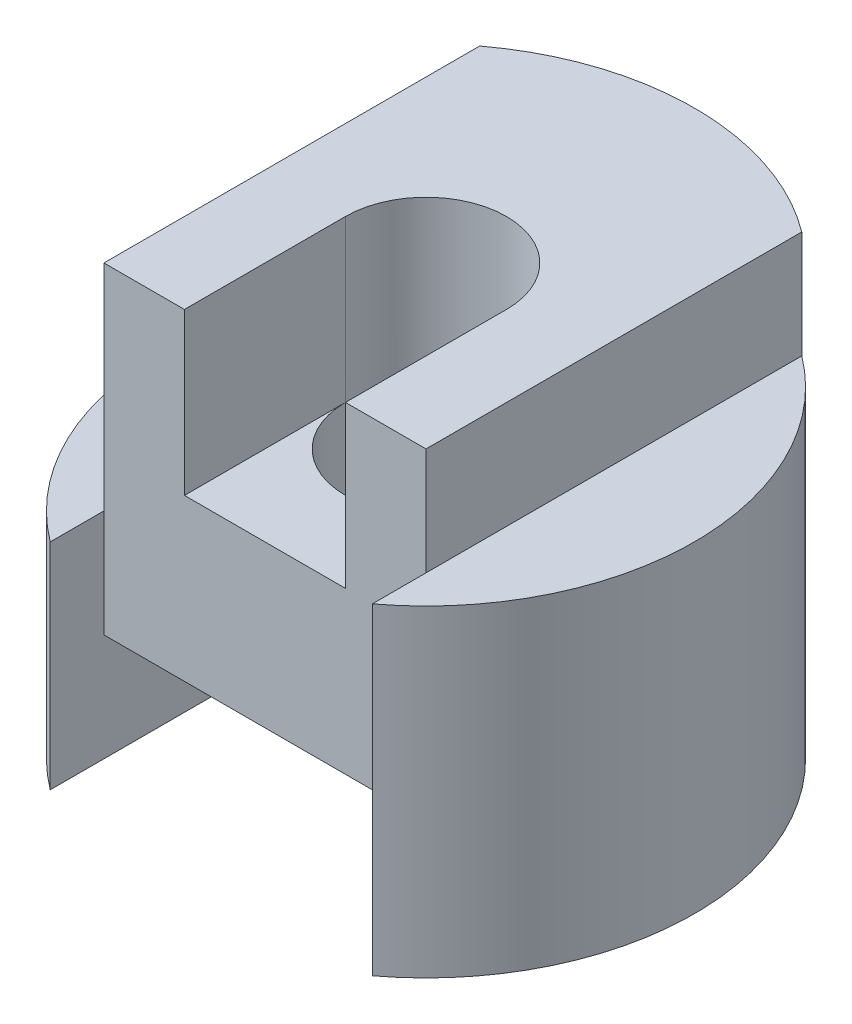
ISO-10303-21;
HEADER;
FILE_DESCRIPTION(('STEP AP214'),'2;1');
FILE_NAME('part.step','',(''),(''),'','','');
FILE_SCHEMA(('AUTOMOTIVE_DESIGN { 1 0 10303 214 1 1 1 1 }'));
ENDSEC;
DATA;
#1=APPLICATION_CONTEXT('core data for automotive mechanical design processes');
#2=APPLICATION_PROTOCOL_DEFINITION('international standard','automotive_design',2000,#1);
#3=PRODUCT_CONTEXT('',#1,'mechanical');
#4=PRODUCT('Part','Part','',(#3));
#5=PRODUCT_RELATED_PRODUCT_CATEGORY('part','',(#4));
#6=PRODUCT_DEFINITION_FORMATION('','',#4);
#7=PRODUCT_DEFINITION_CONTEXT('part definition',#1,'design');
#8=PRODUCT_DEFINITION('design','',#6,#7);
#9=PRODUCT_DEFINITION_SHAPE('','',#8);
#10=(LENGTH_UNIT() NAMED_UNIT(*) SI_UNIT(.MILLI.,.METRE.));
#11=(NAMED_UNIT(*) PLANE_ANGLE_UNIT() SI_UNIT($,.RADIAN.));
#12=(NAMED_UNIT(*) SI_UNIT($,.STERADIAN.) SOLID_ANGLE_UNIT());
#13=UNCERTAINTY_MEASURE_WITH_UNIT(LENGTH_MEASURE(1.E-05),#10,'distance_accuracy_value','');
#14=(GEOMETRIC_REPRESENTATION_CONTEXT(3) GLOBAL_UNCERTAINTY_ASSIGNED_CONTEXT((#13)) GLOBAL_UNIT_ASSIGNED_CONTEXT((#10,
#11,#12)) REPRESENTATION_CONTEXT('',''));
#15=CARTESIAN_POINT('',(0.,0.,0.));
#16=DIRECTION('',(0.,0.,1.));
#17=DIRECTION('',(1.,0.,0.));
#18=AXIS2_PLACEMENT_3D('',#15,#16,#17);
#19=CARTESIAN_POINT('',(0.,8.,0.));
#20=DIRECTION('',(0.,1.,0.));
#21=DIRECTION('',(0.,0.,1.));
#22=AXIS2_PLACEMENT_3D('',#19,#20,#21);
#23=PLANE('',#22);
#24=DIRECTION('',(1.,0.,0.));
#25=VECTOR('',#24,1.);
#26=CARTESIAN_POINT('',(-3.,8.,3.));
#27=LINE('',#26,#25);
#28=CARTESIAN_POINT('',(-3.,8.,3.));
#29=VERTEX_POINT('',#28);
#30=CARTESIAN_POINT('',(-1.5,8.,3.));
#31=VERTEX_POINT('',#30);
#32=EDGE_CURVE('E207',#29,#31,#27,.T.);
#33=ORIENTED_EDGE('',*,*,#32,.T.);
#34=DIRECTION('',(0.,0.,-1.));
#35=VECTOR('',#34,1.);
#36=CARTESIAN_POINT('',(-1.5,8.,18.));
#37=LINE('',#36,#35);
#38=CARTESIAN_POINT('',(-1.5,8.,0.));
#39=VERTEX_POINT('',#38);
#40=EDGE_CURVE('E151',#31,#39,#37,.T.);
#41=ORIENTED_EDGE('',*,*,#40,.T.);
#42=CARTESIAN_POINT('',(0.,8.,0.));
#43=DIRECTION('',(0.,1.,0.));
#44=DIRECTION('',(0.,0.,1.));
#45=AXIS2_PLACEMENT_3D('',#42,#43,#44);
#46=CIRCLE('',#45,1.5);
#47=CARTESIAN_POINT('',(1.5,8.,0.));
#48=VERTEX_POINT('',#47);
#49=EDGE_CURVE('E148',#48,#39,#46,.T.);
#50=ORIENTED_EDGE('',*,*,#49,.F.);
#51=DIRECTION('',(0.,0.,-1.));
#52=VECTOR('',#51,1.);
#53=CARTESIAN_POINT('',(1.5,8.,18.));
#54=LINE('',#53,#52);
#55=CARTESIAN_POINT('',(1.5,8.,3.));
#56=VERTEX_POINT('',#55);
#57=EDGE_CURVE('E48',#56,#48,#54,.T.);
#58=ORIENTED_EDGE('',*,*,#57,.F.);
#59=CARTESIAN_POINT('',(3.,8.,3.));
#60=VERTEX_POINT('',#59);
#61=EDGE_CURVE('E205',#56,#60,#27,.T.);
#62=ORIENTED_EDGE('',*,*,#61,.T.);
#63=DIRECTION('',(0.,0.,1.));
#64=VECTOR('',#63,1.);
#65=CARTESIAN_POINT('',(3.,8.,-9.));
#66=LINE('',#65,#64);
#67=CARTESIAN_POINT('',(3.,8.,-4.));
#68=VERTEX_POINT('',#67);
#69=EDGE_CURVE('E165',#68,#60,#66,.T.);
#70=ORIENTED_EDGE('',*,*,#69,.F.);
#71=CARTESIAN_POINT('',(0.,8.,0.));
#72=DIRECTION('',(0.,1.,0.));
#73=DIRECTION('',(0.,0.,1.));
#74=AXIS2_PLACEMENT_3D('',#71,#72,#73);
#75=CIRCLE('',#74,5.);
#76=CARTESIAN_POINT('',(-3.,8.,-4.));
#77=VERTEX_POINT('',#76);
#78=EDGE_CURVE('E202',#68,#77,#75,.T.);
#79=ORIENTED_EDGE('',*,*,#78,.T.);
#80=DIRECTION('',(0.,0.,1.));
#81=VECTOR('',#80,1.);
#82=CARTESIAN_POINT('',(-3.,8.,-9.));
#83=LINE('',#82,#81);
#84=EDGE_CURVE('E162',#77,#29,#83,.T.);
#85=ORIENTED_EDGE('',*,*,#84,.T.);
#86=EDGE_LOOP('',(#33,#41,#50,#58,#62,#70,#79,#85));
#87=FACE_BOUND('',#86,.T.);
#88=ADVANCED_FACE('F33',(#87),#23,.T.);
#89=CARTESIAN_POINT('',(-3.,8.,3.));
#90=DIRECTION('',(0.,0.,-1.));
#91=DIRECTION('',(-1.,0.,0.));
#92=AXIS2_PLACEMENT_3D('',#89,#90,#91);
#93=PLANE('',#92);
#94=DIRECTION('',(0.,-1.,0.));
#95=VECTOR('',#94,1.);
#96=CARTESIAN_POINT('',(-1.5,8.,3.));
#97=LINE('',#96,#95);
#98=CARTESIAN_POINT('',(-1.5,5.,3.));
#99=VERTEX_POINT('',#98);
#100=EDGE_CURVE('E142',#31,#99,#97,.T.);
#101=ORIENTED_EDGE('',*,*,#100,.F.);
#102=ORIENTED_EDGE('',*,*,#32,.F.);
#103=DIRECTION('',(0.,-1.,0.));
#104=VECTOR('',#103,1.);
#105=CARTESIAN_POINT('',(-3.,8.,3.));
#106=LINE('',#105,#104);
#107=CARTESIAN_POINT('',(-3.,4.,3.));
#108=VERTEX_POINT('',#107);
#109=EDGE_CURVE('E224',#29,#108,#106,.T.);
#110=ORIENTED_EDGE('',*,*,#109,.T.);
#111=CARTESIAN_POINT('',(-3.,2.,3.));
#112=VERTEX_POINT('',#111);
#113=EDGE_CURVE('E223',#108,#112,#106,.T.);
#114=ORIENTED_EDGE('',*,*,#113,.T.);
#115=DIRECTION('',(1.,0.,0.));
#116=VECTOR('',#115,1.);
#117=CARTESIAN_POINT('',(-3.,2.,3.));
#118=LINE('',#117,#116);
#119=CARTESIAN_POINT('',(3.,2.,3.));
#120=VERTEX_POINT('',#119);
#121=EDGE_CURVE('E178',#112,#120,#118,.T.);
#122=ORIENTED_EDGE('',*,*,#121,.T.);
#123=DIRECTION('',(0.,-1.,0.));
#124=VECTOR('',#123,1.);
#125=CARTESIAN_POINT('',(3.,8.,3.));
#126=LINE('',#125,#124);
#127=CARTESIAN_POINT('',(3.,6.,3.));
#128=VERTEX_POINT('',#127);
#129=EDGE_CURVE('E219',#128,#120,#126,.T.);
#130=ORIENTED_EDGE('',*,*,#129,.F.);
#131=EDGE_CURVE('E220',#60,#128,#126,.T.);
#132=ORIENTED_EDGE('',*,*,#131,.F.);
#133=ORIENTED_EDGE('',*,*,#61,.F.);
#134=DIRECTION('',(0.,1.,0.));
#135=VECTOR('',#134,1.);
#136=CARTESIAN_POINT('',(1.5,8.,3.));
#137=LINE('',#136,#135);
#138=CARTESIAN_POINT('',(1.5,5.,3.));
#139=VERTEX_POINT('',#138);
#140=EDGE_CURVE('E143',#139,#56,#137,.T.);
#141=ORIENTED_EDGE('',*,*,#140,.F.);
#142=DIRECTION('',(1.,0.,0.));
#143=VECTOR('',#142,1.);
#144=CARTESIAN_POINT('',(-3.,5.,3.));
#145=LINE('',#144,#143);
#146=EDGE_CURVE('E158',#99,#139,#145,.T.);
#147=ORIENTED_EDGE('',*,*,#146,.F.);
#148=EDGE_LOOP('',(#101,#102,#110,#114,#122,#130,#132,#133,#141,#147));
#149=FACE_BOUND('',#148,.T.);
#150=ADVANCED_FACE('F241',(#149),#93,.F.);
#151=CARTESIAN_POINT('',(0.,8.,0.));
#152=DIRECTION('',(0.,-1.,0.));
#153=DIRECTION('',(0.,0.,-1.));
#154=AXIS2_PLACEMENT_3D('',#151,#152,#153);
#155=CYLINDRICAL_SURFACE('',#154,1.5);
#156=CARTESIAN_POINT('',(0.,2.,0.));
#157=DIRECTION('',(0.,1.,0.));
#158=DIRECTION('',(0.,0.,1.));
#159=AXIS2_PLACEMENT_3D('',#156,#157,#158);
#160=CIRCLE('',#159,1.5);
#161=CARTESIAN_POINT('',(0.,2.,1.5));
#162=VERTEX_POINT('',#161);
#163=EDGE_CURVE('E175',#162,#162,#160,.T.);
#164=ORIENTED_EDGE('',*,*,#163,.F.);
#165=EDGE_LOOP('',(#164));
#166=FACE_BOUND('',#165,.T.);
#167=ORIENTED_EDGE('',*,*,#49,.T.);
#168=DIRECTION('',(0.,-1.,0.));
#169=VECTOR('',#168,1.);
#170=CARTESIAN_POINT('',(-1.5,8.,0.));
#171=LINE('',#170,#169);
#172=CARTESIAN_POINT('',(-1.5,5.,0.));
#173=VERTEX_POINT('',#172);
#174=EDGE_CURVE('E139',#39,#173,#171,.T.);
#175=ORIENTED_EDGE('',*,*,#174,.T.);
#176=CARTESIAN_POINT('',(0.,5.,0.));
#177=DIRECTION('',(0.,1.,0.));
#178=DIRECTION('',(0.,0.,1.));
#179=AXIS2_PLACEMENT_3D('',#176,#177,#178);
#180=CIRCLE('',#179,1.5);
#181=CARTESIAN_POINT('',(1.5,5.,0.));
#182=VERTEX_POINT('',#181);
#183=EDGE_CURVE('E11',#173,#182,#180,.T.);
#184=ORIENTED_EDGE('',*,*,#183,.T.);
#185=DIRECTION('',(0.,1.,0.));
#186=VECTOR('',#185,1.);
#187=CARTESIAN_POINT('',(1.5,8.,0.));
#188=LINE('',#187,#186);
#189=EDGE_CURVE('E149',#182,#48,#188,.T.);
#190=ORIENTED_EDGE('',*,*,#189,.T.);
#191=EDGE_LOOP('',(#167,#175,#184,#190));
#192=FACE_BOUND('',#191,.T.);
#193=ADVANCED_FACE('F146',(#166,#192),#155,.F.);
#194=CARTESIAN_POINT('',(0.,0.,0.));
#195=DIRECTION('',(0.,1.,0.));
#196=DIRECTION('',(0.,0.,1.));
#197=AXIS2_PLACEMENT_3D('',#194,#195,#196);
#198=PLANE('',#197);
#199=CARTESIAN_POINT('',(0.,0.,0.));
#200=DIRECTION('',(0.,1.,0.));
#201=DIRECTION('',(0.,0.,1.));
#202=AXIS2_PLACEMENT_3D('',#199,#200,#201);
#203=CIRCLE('',#202,5.);
#204=CARTESIAN_POINT('',(-3.,0.,-4.));
#205=VERTEX_POINT('',#204);
#206=CARTESIAN_POINT('',(-3.,0.,4.));
#207=VERTEX_POINT('',#206);
#208=EDGE_CURVE('E201',#205,#207,#203,.T.);
#209=ORIENTED_EDGE('',*,*,#208,.F.);
#210=DIRECTION('',(0.,0.,-1.));
#211=VECTOR('',#210,1.);
#212=CARTESIAN_POINT('',(-3.,0.,4.));
#213=LINE('',#212,#211);
#214=EDGE_CURVE('E214',#207,#205,#213,.T.);
#215=ORIENTED_EDGE('',*,*,#214,.F.);
#216=EDGE_LOOP('',(#209,#215));
#217=FACE_BOUND('',#216,.T.);
#218=ADVANCED_FACE('F256',(#217),#198,.F.);
#219=DIRECTION('',(0.,0.,1.));
#220=VECTOR('',#219,1.);
#221=CARTESIAN_POINT('',(3.,0.,4.));
#222=LINE('',#221,#220);
#223=CARTESIAN_POINT('',(3.,0.,-4.));
#224=VERTEX_POINT('',#223);
#225=CARTESIAN_POINT('',(3.,0.,4.));
#226=VERTEX_POINT('',#225);
#227=EDGE_CURVE('E206',#224,#226,#222,.T.);
#228=ORIENTED_EDGE('',*,*,#227,.F.);
#229=EDGE_CURVE('E211',#226,#224,#203,.T.);
#230=ORIENTED_EDGE('',*,*,#229,.F.);
#231=EDGE_LOOP('',(#228,#230));
#232=FACE_BOUND('',#231,.T.);
#233=ADVANCED_FACE('F258',(#232),#198,.F.);
#234=CARTESIAN_POINT('',(0.,8.,0.));
#235=DIRECTION('',(0.,-1.,0.));
#236=DIRECTION('',(0.,0.,-1.));
#237=AXIS2_PLACEMENT_3D('',#234,#235,#236);
#238=CYLINDRICAL_SURFACE('',#237,5.);
#239=CARTESIAN_POINT('',(0.,2.,0.));
#240=DIRECTION('',(0.,1.,0.));
#241=DIRECTION('',(0.,0.,1.));
#242=AXIS2_PLACEMENT_3D('',#239,#240,#241);
#243=CIRCLE('',#242,5.);
#244=CARTESIAN_POINT('',(3.,2.,-4.));
#245=VERTEX_POINT('',#244);
#246=CARTESIAN_POINT('',(-3.,2.,-4.));
#247=VERTEX_POINT('',#246);
#248=EDGE_CURVE('E181',#245,#247,#243,.T.);
#249=ORIENTED_EDGE('',*,*,#248,.T.);
#250=DIRECTION('',(0.,-1.,0.));
#251=VECTOR('',#250,1.);
#252=CARTESIAN_POINT('',(-3.,8.,-4.));
#253=LINE('',#252,#251);
#254=EDGE_CURVE('E195',#247,#205,#253,.T.);
#255=ORIENTED_EDGE('',*,*,#254,.T.);
#256=ORIENTED_EDGE('',*,*,#208,.T.);
#257=DIRECTION('',(0.,-1.,0.));
#258=VECTOR('',#257,1.);
#259=CARTESIAN_POINT('',(-3.,8.,4.));
#260=LINE('',#259,#258);
#261=CARTESIAN_POINT('',(-3.,4.,4.));
#262=VERTEX_POINT('',#261);
#263=EDGE_CURVE('E227',#262,#207,#260,.T.);
#264=ORIENTED_EDGE('',*,*,#263,.F.);
#265=CARTESIAN_POINT('',(0.,4.,0.));
#266=DIRECTION('',(0.,-1.,0.));
#267=DIRECTION('',(0.,0.,-1.));
#268=AXIS2_PLACEMENT_3D('',#265,#266,#267);
#269=CIRCLE('',#268,5.);
#270=CARTESIAN_POINT('',(-3.,4.,-4.));
#271=VERTEX_POINT('',#270);
#272=EDGE_CURVE('E198',#262,#271,#269,.T.);
#273=ORIENTED_EDGE('',*,*,#272,.T.);
#274=DIRECTION('',(0.,-1.,0.));
#275=VECTOR('',#274,1.);
#276=CARTESIAN_POINT('',(-3.,8.,-4.));
#277=LINE('',#276,#275);
#278=EDGE_CURVE('E189',#271,#77,#277,.F.);
#279=ORIENTED_EDGE('',*,*,#278,.T.);
#280=ORIENTED_EDGE('',*,*,#78,.F.);
#281=DIRECTION('',(0.,-1.,0.));
#282=VECTOR('',#281,1.);
#283=CARTESIAN_POINT('',(3.,8.,-4.));
#284=LINE('',#283,#282);
#285=CARTESIAN_POINT('',(3.,6.,-4.));
#286=VERTEX_POINT('',#285);
#287=EDGE_CURVE('E186',#68,#286,#284,.T.);
#288=ORIENTED_EDGE('',*,*,#287,.T.);
#289=CARTESIAN_POINT('',(0.,6.,0.));
#290=DIRECTION('',(0.,-1.,0.));
#291=DIRECTION('',(1.,0.,0.));
#292=AXIS2_PLACEMENT_3D('',#289,#290,#291);
#293=CIRCLE('',#292,5.);
#294=CARTESIAN_POINT('',(3.,6.,4.));
#295=VERTEX_POINT('',#294);
#296=EDGE_CURVE('E184',#286,#295,#293,.T.);
#297=ORIENTED_EDGE('',*,*,#296,.T.);
#298=DIRECTION('',(0.,-1.,0.));
#299=VECTOR('',#298,1.);
#300=CARTESIAN_POINT('',(3.,8.,4.));
#301=LINE('',#300,#299);
#302=EDGE_CURVE('E210',#295,#226,#301,.T.);
#303=ORIENTED_EDGE('',*,*,#302,.T.);
#304=ORIENTED_EDGE('',*,*,#229,.T.);
#305=DIRECTION('',(0.,-1.,0.));
#306=VECTOR('',#305,1.);
#307=CARTESIAN_POINT('',(3.,8.,-4.));
#308=LINE('',#307,#306);
#309=EDGE_CURVE('E192',#224,#245,#308,.F.);
#310=ORIENTED_EDGE('',*,*,#309,.T.);
#311=EDGE_LOOP('',(#249,#255,#256,#264,#273,#279,#280,#288,#297,#303,#304,#310));
#312=FACE_BOUND('',#311,.T.);
#313=ADVANCED_FACE('F35',(#312),#238,.T.);
#314=CARTESIAN_POINT('',(-3.,8.,4.));
#315=DIRECTION('',(-1.,0.,0.));
#316=DIRECTION('',(0.,0.,1.));
#317=AXIS2_PLACEMENT_3D('',#314,#315,#316);
#318=PLANE('',#317);
#319=ORIENTED_EDGE('',*,*,#263,.T.);
#320=ORIENTED_EDGE('',*,*,#214,.T.);
#321=ORIENTED_EDGE('',*,*,#254,.F.);
#322=DIRECTION('',(0.,0.,1.));
#323=VECTOR('',#322,1.);
#324=CARTESIAN_POINT('',(-3.,2.,-9.));
#325=LINE('',#324,#323);
#326=EDGE_CURVE('E169',#247,#112,#325,.T.);
#327=ORIENTED_EDGE('',*,*,#326,.T.);
#328=ORIENTED_EDGE('',*,*,#113,.F.);
#329=DIRECTION('',(0.,0.,1.));
#330=VECTOR('',#329,1.);
#331=CARTESIAN_POINT('',(-3.,4.,-9.));
#332=LINE('',#331,#330);
#333=EDGE_CURVE('E166',#108,#262,#332,.T.);
#334=ORIENTED_EDGE('',*,*,#333,.T.);
#335=EDGE_LOOP('',(#319,#320,#321,#327,#328,#334));
#336=FACE_BOUND('',#335,.T.);
#337=ADVANCED_FACE('F249',(#336),#318,.F.);
#338=CARTESIAN_POINT('',(3.,8.,4.));
#339=DIRECTION('',(1.,0.,0.));
#340=DIRECTION('',(0.,0.,-1.));
#341=AXIS2_PLACEMENT_3D('',#338,#339,#340);
#342=PLANE('',#341);
#343=ORIENTED_EDGE('',*,*,#129,.T.);
#344=DIRECTION('',(0.,0.,1.));
#345=VECTOR('',#344,1.);
#346=CARTESIAN_POINT('',(3.,2.,-9.));
#347=LINE('',#346,#345);
#348=EDGE_CURVE('E161',#245,#120,#347,.T.);
#349=ORIENTED_EDGE('',*,*,#348,.F.);
#350=ORIENTED_EDGE('',*,*,#309,.F.);
#351=ORIENTED_EDGE('',*,*,#227,.T.);
#352=ORIENTED_EDGE('',*,*,#302,.F.);
#353=DIRECTION('',(0.,0.,-1.));
#354=VECTOR('',#353,1.);
#355=CARTESIAN_POINT('',(3.,6.,4.));
#356=LINE('',#355,#354);
#357=EDGE_CURVE('E41',#295,#128,#356,.T.);
#358=ORIENTED_EDGE('',*,*,#357,.T.);
#359=EDGE_LOOP('',(#343,#349,#350,#351,#352,#358));
#360=FACE_BOUND('',#359,.T.);
#361=ADVANCED_FACE('F236',(#360),#342,.F.);
#362=CARTESIAN_POINT('',(-3.,2.,-9.));
#363=DIRECTION('',(0.,1.,0.));
#364=DIRECTION('',(0.,0.,1.));
#365=AXIS2_PLACEMENT_3D('',#362,#363,#364);
#366=PLANE('',#365);
#367=ORIENTED_EDGE('',*,*,#163,.T.);
#368=EDGE_LOOP('',(#367));
#369=FACE_BOUND('',#368,.T.);
#370=ORIENTED_EDGE('',*,*,#348,.T.);
#371=ORIENTED_EDGE('',*,*,#121,.F.);
#372=ORIENTED_EDGE('',*,*,#326,.F.);
#373=ORIENTED_EDGE('',*,*,#248,.F.);
#374=EDGE_LOOP('',(#370,#371,#372,#373));
#375=FACE_BOUND('',#374,.T.);
#376=ADVANCED_FACE('F247',(#369,#375),#366,.F.);
#377=CARTESIAN_POINT('',(3.,8.,-9.));
#378=DIRECTION('',(-1.,0.,0.));
#379=DIRECTION('',(0.,0.,1.));
#380=AXIS2_PLACEMENT_3D('',#377,#378,#379);
#381=PLANE('',#380);
#382=ORIENTED_EDGE('',*,*,#69,.T.);
#383=ORIENTED_EDGE('',*,*,#131,.T.);
#384=DIRECTION('',(0.,0.,1.));
#385=VECTOR('',#384,1.);
#386=CARTESIAN_POINT('',(3.,6.,-9.));
#387=LINE('',#386,#385);
#388=EDGE_CURVE('E173',#286,#128,#387,.T.);
#389=ORIENTED_EDGE('',*,*,#388,.F.);
#390=ORIENTED_EDGE('',*,*,#287,.F.);
#391=EDGE_LOOP('',(#382,#383,#389,#390));
#392=FACE_BOUND('',#391,.T.);
#393=ADVANCED_FACE('F276',(#392),#381,.F.);
#394=CARTESIAN_POINT('',(5.,6.,-9.));
#395=DIRECTION('',(0.,-1.,0.));
#396=DIRECTION('',(1.,0.,0.));
#397=AXIS2_PLACEMENT_3D('',#394,#395,#396);
#398=PLANE('',#397);
#399=ORIENTED_EDGE('',*,*,#296,.F.);
#400=ORIENTED_EDGE('',*,*,#388,.T.);
#401=ORIENTED_EDGE('',*,*,#357,.F.);
#402=EDGE_LOOP('',(#399,#400,#401));
#403=FACE_BOUND('',#402,.T.);
#404=ADVANCED_FACE('F279',(#403),#398,.F.);
#405=CARTESIAN_POINT('',(-5.,4.,-9.));
#406=DIRECTION('',(0.,-1.,0.));
#407=DIRECTION('',(0.,0.,-1.));
#408=AXIS2_PLACEMENT_3D('',#405,#406,#407);
#409=PLANE('',#408);
#410=ORIENTED_EDGE('',*,*,#333,.F.);
#411=EDGE_CURVE('E56',#271,#108,#332,.T.);
#412=ORIENTED_EDGE('',*,*,#411,.F.);
#413=ORIENTED_EDGE('',*,*,#272,.F.);
#414=EDGE_LOOP('',(#410,#412,#413));
#415=FACE_BOUND('',#414,.T.);
#416=ADVANCED_FACE('F283',(#415),#409,.F.);
#417=CARTESIAN_POINT('',(-3.,8.,-9.));
#418=DIRECTION('',(1.,0.,0.));
#419=DIRECTION('',(0.,0.,-1.));
#420=AXIS2_PLACEMENT_3D('',#417,#418,#419);
#421=PLANE('',#420);
#422=ORIENTED_EDGE('',*,*,#411,.T.);
#423=ORIENTED_EDGE('',*,*,#109,.F.);
#424=ORIENTED_EDGE('',*,*,#84,.F.);
#425=ORIENTED_EDGE('',*,*,#278,.F.);
#426=EDGE_LOOP('',(#422,#423,#424,#425));
#427=FACE_BOUND('',#426,.T.);
#428=ADVANCED_FACE('F289',(#427),#421,.F.);
#429=CARTESIAN_POINT('',(-1.5,8.,18.));
#430=DIRECTION('',(1.,0.,0.));
#431=DIRECTION('',(0.,1.,0.));
#432=AXIS2_PLACEMENT_3D('',#429,#430,#431);
#433=PLANE('',#432);
#434=ORIENTED_EDGE('',*,*,#100,.T.);
#435=DIRECTION('',(0.,0.,-1.));
#436=VECTOR('',#435,1.);
#437=CARTESIAN_POINT('',(-1.5,5.,18.));
#438=LINE('',#437,#436);
#439=EDGE_CURVE('E131',#99,#173,#438,.T.);
#440=ORIENTED_EDGE('',*,*,#439,.T.);
#441=ORIENTED_EDGE('',*,*,#174,.F.);
#442=ORIENTED_EDGE('',*,*,#40,.F.);
#443=EDGE_LOOP('',(#434,#440,#441,#442));
#444=FACE_BOUND('',#443,.T.);
#445=ADVANCED_FACE('F138',(#444),#433,.T.);
#446=CARTESIAN_POINT('',(-1.5,5.,18.));
#447=DIRECTION('',(0.,1.,0.));
#448=DIRECTION('',(0.,0.,1.));
#449=AXIS2_PLACEMENT_3D('',#446,#447,#448);
#450=PLANE('',#449);
#451=ORIENTED_EDGE('',*,*,#146,.T.);
#452=DIRECTION('',(0.,0.,-1.));
#453=VECTOR('',#452,1.);
#454=CARTESIAN_POINT('',(1.5,5.,18.));
#455=LINE('',#454,#453);
#456=EDGE_CURVE('E134',#139,#182,#455,.T.);
#457=ORIENTED_EDGE('',*,*,#456,.T.);
#458=ORIENTED_EDGE('',*,*,#183,.F.);
#459=ORIENTED_EDGE('',*,*,#439,.F.);
#460=EDGE_LOOP('',(#451,#457,#458,#459));
#461=FACE_BOUND('',#460,.T.);
#462=ADVANCED_FACE('F130',(#461),#450,.T.);
#463=CARTESIAN_POINT('',(1.5,8.,18.));
#464=DIRECTION('',(-1.,0.,0.));
#465=DIRECTION('',(0.,0.,1.));
#466=AXIS2_PLACEMENT_3D('',#463,#464,#465);
#467=PLANE('',#466);
#468=ORIENTED_EDGE('',*,*,#140,.T.);
#469=ORIENTED_EDGE('',*,*,#57,.T.);
#470=ORIENTED_EDGE('',*,*,#189,.F.);
#471=ORIENTED_EDGE('',*,*,#456,.F.);
#472=EDGE_LOOP('',(#468,#469,#470,#471));
#473=FACE_BOUND('',#472,.T.);
#474=ADVANCED_FACE('F297',(#473),#467,.T.);
#475=CLOSED_SHELL('',(#88,#150,#193,#218,#233,#313,#337,#361,#376,#393,#404,#416,#428,#445,#462,#474));
#476=MANIFOLD_SOLID_BREP('B2',#475);
#477=ADVANCED_BREP_SHAPE_REPRESENTATION('',(#18,#476),#14);
#478=SHAPE_DEFINITION_REPRESENTATION(#9,#477);
ENDSEC;
END-ISO-10303-21;
